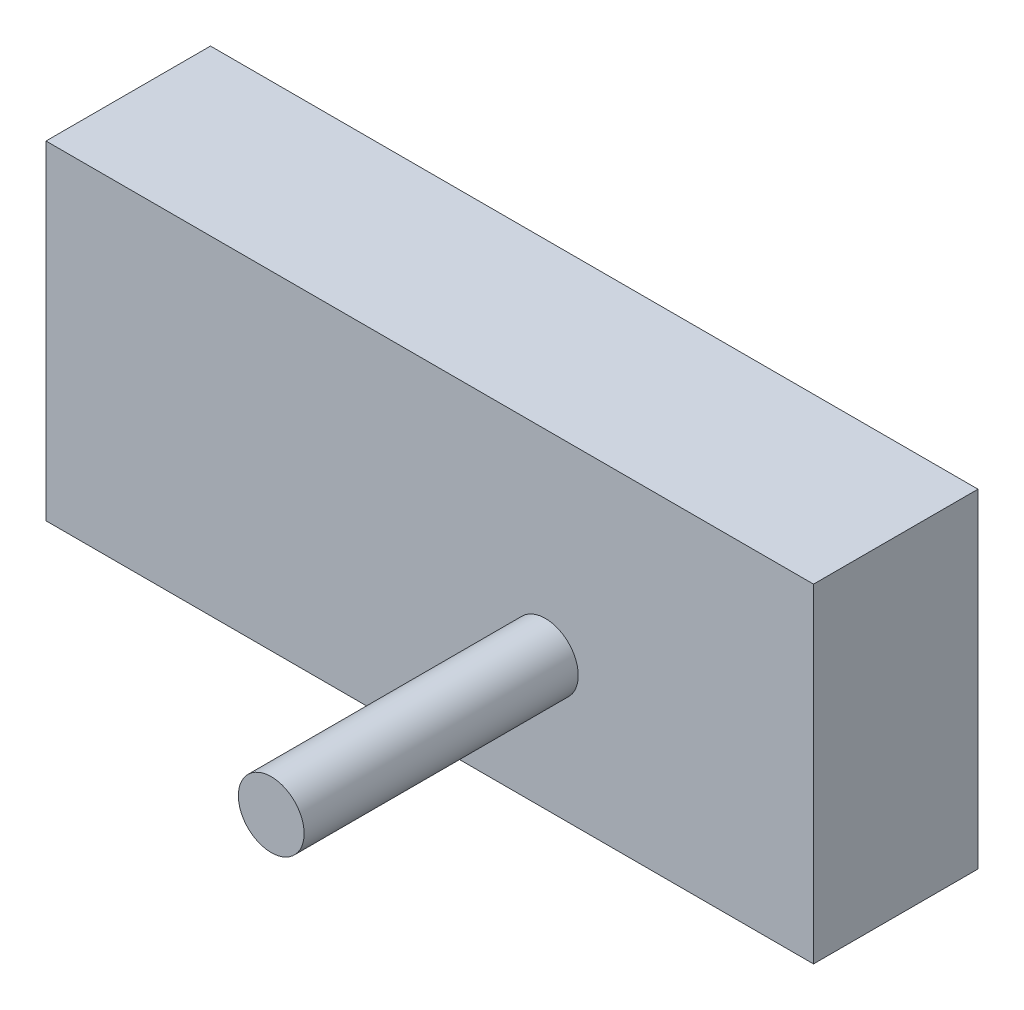
ISO-10303-21;
HEADER;
FILE_DESCRIPTION(('STEP AP214'),'2;1');
FILE_NAME('part.step','',(''),(''),'','','');
FILE_SCHEMA(('AUTOMOTIVE_DESIGN { 1 0 10303 214 1 1 1 1 }'));
ENDSEC;
DATA;
#1=APPLICATION_CONTEXT('core data for automotive mechanical design processes');
#2=APPLICATION_PROTOCOL_DEFINITION('international standard','automotive_design',2000,#1);
#3=PRODUCT_CONTEXT('',#1,'mechanical');
#4=PRODUCT('Part','Part','',(#3));
#5=PRODUCT_RELATED_PRODUCT_CATEGORY('part','',(#4));
#6=PRODUCT_DEFINITION_FORMATION('','',#4);
#7=PRODUCT_DEFINITION_CONTEXT('part definition',#1,'design');
#8=PRODUCT_DEFINITION('design','',#6,#7);
#9=PRODUCT_DEFINITION_SHAPE('','',#8);
#10=(LENGTH_UNIT() NAMED_UNIT(*) SI_UNIT(.MILLI.,.METRE.));
#11=(NAMED_UNIT(*) PLANE_ANGLE_UNIT() SI_UNIT($,.RADIAN.));
#12=(NAMED_UNIT(*) SI_UNIT($,.STERADIAN.) SOLID_ANGLE_UNIT());
#13=UNCERTAINTY_MEASURE_WITH_UNIT(LENGTH_MEASURE(1.E-05),#10,'distance_accuracy_value','');
#14=(GEOMETRIC_REPRESENTATION_CONTEXT(3) GLOBAL_UNCERTAINTY_ASSIGNED_CONTEXT((#13)) GLOBAL_UNIT_ASSIGNED_CONTEXT((#10,
#11,#12)) REPRESENTATION_CONTEXT('',''));
#15=CARTESIAN_POINT('',(0.,0.,0.));
#16=DIRECTION('',(0.,0.,1.));
#17=DIRECTION('',(1.,0.,0.));
#18=AXIS2_PLACEMENT_3D('',#15,#16,#17);
#19=CARTESIAN_POINT('',(-47.7419354838709,29.8387096774194,30.));
#20=DIRECTION('',(1.,0.,0.));
#21=DIRECTION('',(0.,0.,-1.));
#22=AXIS2_PLACEMENT_3D('',#19,#20,#21);
#23=PLANE('',#22);
#24=DIRECTION('',(0.,-1.,0.));
#25=VECTOR('',#24,1.);
#26=CARTESIAN_POINT('',(-47.7419354838709,29.8387096774194,0.));
#27=LINE('',#26,#25);
#28=CARTESIAN_POINT('',(-47.7419354838709,29.8387096774194,0.));
#29=VERTEX_POINT('',#28);
#30=CARTESIAN_POINT('',(-47.7419354838709,-30.1612903225806,0.));
#31=VERTEX_POINT('',#30);
#32=EDGE_CURVE('E96',#29,#31,#27,.T.);
#33=ORIENTED_EDGE('',*,*,#32,.T.);
#34=DIRECTION('',(0.,0.,-1.));
#35=VECTOR('',#34,1.);
#36=CARTESIAN_POINT('',(-47.7419354838709,-30.1612903225806,30.));
#37=LINE('',#36,#35);
#38=CARTESIAN_POINT('',(-47.7419354838709,-30.1612903225806,30.));
#39=VERTEX_POINT('',#38);
#40=EDGE_CURVE('E11',#39,#31,#37,.T.);
#41=ORIENTED_EDGE('',*,*,#40,.F.);
#42=DIRECTION('',(0.,-1.,0.));
#43=VECTOR('',#42,1.);
#44=CARTESIAN_POINT('',(-47.7419354838709,29.8387096774194,30.));
#45=LINE('',#44,#43);
#46=CARTESIAN_POINT('',(-47.7419354838709,29.8387096774194,30.));
#47=VERTEX_POINT('',#46);
#48=EDGE_CURVE('E84',#47,#39,#45,.T.);
#49=ORIENTED_EDGE('',*,*,#48,.F.);
#50=DIRECTION('',(0.,0.,-1.));
#51=VECTOR('',#50,1.);
#52=CARTESIAN_POINT('',(-47.7419354838709,29.8387096774194,30.));
#53=LINE('',#52,#51);
#54=EDGE_CURVE('E92',#47,#29,#53,.T.);
#55=ORIENTED_EDGE('',*,*,#54,.T.);
#56=EDGE_LOOP('',(#33,#41,#49,#55));
#57=FACE_BOUND('',#56,.T.);
#58=ADVANCED_FACE('F33',(#57),#23,.F.);
#59=CARTESIAN_POINT('',(-47.7419354838709,-30.1612903225806,30.));
#60=DIRECTION('',(0.,1.,0.));
#61=DIRECTION('',(-1.,0.,0.));
#62=AXIS2_PLACEMENT_3D('',#59,#60,#61);
#63=PLANE('',#62);
#64=DIRECTION('',(1.,0.,0.));
#65=VECTOR('',#64,1.);
#66=CARTESIAN_POINT('',(-47.7419354838709,-30.1612903225806,0.));
#67=LINE('',#66,#65);
#68=CARTESIAN_POINT('',(92.2580645161291,-30.1612903225806,0.));
#69=VERTEX_POINT('',#68);
#70=EDGE_CURVE('E88',#31,#69,#67,.T.);
#71=ORIENTED_EDGE('',*,*,#70,.T.);
#72=DIRECTION('',(0.,0.,-1.));
#73=VECTOR('',#72,1.);
#74=CARTESIAN_POINT('',(92.2580645161291,-30.1612903225806,30.));
#75=LINE('',#74,#73);
#76=CARTESIAN_POINT('',(92.2580645161291,-30.1612903225806,30.));
#77=VERTEX_POINT('',#76);
#78=EDGE_CURVE('E41',#77,#69,#75,.T.);
#79=ORIENTED_EDGE('',*,*,#78,.F.);
#80=DIRECTION('',(1.,0.,0.));
#81=VECTOR('',#80,1.);
#82=CARTESIAN_POINT('',(-47.7419354838709,-30.1612903225806,30.));
#83=LINE('',#82,#81);
#84=EDGE_CURVE('E79',#39,#77,#83,.T.);
#85=ORIENTED_EDGE('',*,*,#84,.F.);
#86=ORIENTED_EDGE('',*,*,#40,.T.);
#87=EDGE_LOOP('',(#71,#79,#85,#86));
#88=FACE_BOUND('',#87,.T.);
#89=ADVANCED_FACE('F87',(#88),#63,.F.);
#90=CARTESIAN_POINT('',(92.2580645161291,29.8387096774194,30.));
#91=DIRECTION('',(-1.,0.,0.));
#92=DIRECTION('',(0.,0.,1.));
#93=AXIS2_PLACEMENT_3D('',#90,#91,#92);
#94=PLANE('',#93);
#95=DIRECTION('',(0.,1.,0.));
#96=VECTOR('',#95,1.);
#97=CARTESIAN_POINT('',(92.2580645161291,29.8387096774194,0.));
#98=LINE('',#97,#96);
#99=CARTESIAN_POINT('',(92.2580645161291,29.8387096774194,0.));
#100=VERTEX_POINT('',#99);
#101=EDGE_CURVE('E66',#69,#100,#98,.T.);
#102=ORIENTED_EDGE('',*,*,#101,.T.);
#103=DIRECTION('',(0.,0.,-1.));
#104=VECTOR('',#103,1.);
#105=CARTESIAN_POINT('',(92.2580645161291,29.8387096774194,30.));
#106=LINE('',#105,#104);
#107=CARTESIAN_POINT('',(92.2580645161291,29.8387096774194,30.));
#108=VERTEX_POINT('',#107);
#109=EDGE_CURVE('E89',#108,#100,#106,.T.);
#110=ORIENTED_EDGE('',*,*,#109,.F.);
#111=DIRECTION('',(0.,1.,0.));
#112=VECTOR('',#111,1.);
#113=CARTESIAN_POINT('',(92.2580645161291,29.8387096774194,30.));
#114=LINE('',#113,#112);
#115=EDGE_CURVE('E82',#77,#108,#114,.T.);
#116=ORIENTED_EDGE('',*,*,#115,.F.);
#117=ORIENTED_EDGE('',*,*,#78,.T.);
#118=EDGE_LOOP('',(#102,#110,#116,#117));
#119=FACE_BOUND('',#118,.T.);
#120=ADVANCED_FACE('F90',(#119),#94,.F.);
#121=CARTESIAN_POINT('',(-47.7419354838709,29.8387096774194,30.));
#122=DIRECTION('',(0.,-1.,0.));
#123=DIRECTION('',(0.,0.,-1.));
#124=AXIS2_PLACEMENT_3D('',#121,#122,#123);
#125=PLANE('',#124);
#126=DIRECTION('',(-1.,0.,0.));
#127=VECTOR('',#126,1.);
#128=CARTESIAN_POINT('',(-47.7419354838709,29.8387096774194,0.));
#129=LINE('',#128,#127);
#130=EDGE_CURVE('E72',#100,#29,#129,.T.);
#131=ORIENTED_EDGE('',*,*,#130,.T.);
#132=ORIENTED_EDGE('',*,*,#54,.F.);
#133=DIRECTION('',(-1.,0.,0.));
#134=VECTOR('',#133,1.);
#135=CARTESIAN_POINT('',(-47.7419354838709,29.8387096774194,30.));
#136=LINE('',#135,#134);
#137=EDGE_CURVE('E49',#108,#47,#136,.T.);
#138=ORIENTED_EDGE('',*,*,#137,.F.);
#139=ORIENTED_EDGE('',*,*,#109,.T.);
#140=EDGE_LOOP('',(#131,#132,#138,#139));
#141=FACE_BOUND('',#140,.T.);
#142=ADVANCED_FACE('F104',(#141),#125,.F.);
#143=CARTESIAN_POINT('',(0.,0.,30.));
#144=DIRECTION('',(0.,0.,1.));
#145=DIRECTION('',(1.,0.,0.));
#146=AXIS2_PLACEMENT_3D('',#143,#144,#145);
#147=PLANE('',#146);
#148=CARTESIAN_POINT('',(43.3422304037495,-6.03131377992942,30.));
#149=DIRECTION('',(0.,0.,1.));
#150=DIRECTION('',(1.,0.,0.));
#151=AXIS2_PLACEMENT_3D('',#148,#149,#150);
#152=CIRCLE('',#151,6.);
#153=CARTESIAN_POINT('',(49.3422304037495,-6.03131377992942,30.));
#154=VERTEX_POINT('',#153);
#155=EDGE_CURVE('E110',#154,#154,#152,.T.);
#156=ORIENTED_EDGE('',*,*,#155,.F.);
#157=EDGE_LOOP('',(#156));
#158=FACE_BOUND('',#157,.T.);
#159=ORIENTED_EDGE('',*,*,#48,.T.);
#160=ORIENTED_EDGE('',*,*,#84,.T.);
#161=ORIENTED_EDGE('',*,*,#115,.T.);
#162=ORIENTED_EDGE('',*,*,#137,.T.);
#163=EDGE_LOOP('',(#159,#160,#161,#162));
#164=FACE_BOUND('',#163,.T.);
#165=ADVANCED_FACE('F80',(#158,#164),#147,.T.);
#166=CARTESIAN_POINT('',(0.,0.,0.));
#167=DIRECTION('',(0.,0.,1.));
#168=DIRECTION('',(1.,0.,0.));
#169=AXIS2_PLACEMENT_3D('',#166,#167,#168);
#170=PLANE('',#169);
#171=ORIENTED_EDGE('',*,*,#32,.F.);
#172=ORIENTED_EDGE('',*,*,#130,.F.);
#173=ORIENTED_EDGE('',*,*,#101,.F.);
#174=ORIENTED_EDGE('',*,*,#70,.F.);
#175=EDGE_LOOP('',(#171,#172,#173,#174));
#176=FACE_BOUND('',#175,.T.);
#177=ADVANCED_FACE('F107',(#176),#170,.F.);
#178=CARTESIAN_POINT('',(43.3422304037495,-6.03131377992942,80.));
#179=DIRECTION('',(0.,0.,-1.));
#180=DIRECTION('',(-1.,0.,0.));
#181=AXIS2_PLACEMENT_3D('',#178,#179,#180);
#182=CYLINDRICAL_SURFACE('',#181,6.);
#183=CARTESIAN_POINT('',(43.3422304037495,-6.03131377992942,80.));
#184=DIRECTION('',(0.,0.,1.));
#185=DIRECTION('',(1.,0.,0.));
#186=AXIS2_PLACEMENT_3D('',#183,#184,#185);
#187=CIRCLE('',#186,6.);
#188=CARTESIAN_POINT('',(49.3422304037495,-6.03131377992942,80.));
#189=VERTEX_POINT('',#188);
#190=EDGE_CURVE('E99',#189,#189,#187,.T.);
#191=ORIENTED_EDGE('',*,*,#190,.F.);
#192=EDGE_LOOP('',(#191));
#193=FACE_BOUND('',#192,.T.);
#194=ORIENTED_EDGE('',*,*,#155,.T.);
#195=EDGE_LOOP('',(#194));
#196=FACE_BOUND('',#195,.T.);
#197=ADVANCED_FACE('F118',(#193,#196),#182,.T.);
#198=CARTESIAN_POINT('',(43.3422304037495,-6.03131377992942,80.));
#199=DIRECTION('',(0.,0.,1.));
#200=DIRECTION('',(1.,0.,0.));
#201=AXIS2_PLACEMENT_3D('',#198,#199,#200);
#202=PLANE('',#201);
#203=ORIENTED_EDGE('',*,*,#190,.T.);
#204=EDGE_LOOP('',(#203));
#205=FACE_BOUND('',#204,.T.);
#206=ADVANCED_FACE('F116',(#205),#202,.T.);
#207=CLOSED_SHELL('',(#58,#89,#120,#142,#165,#177,#197,#206));
#208=MANIFOLD_SOLID_BREP('B2',#207);
#209=ADVANCED_BREP_SHAPE_REPRESENTATION('',(#18,#208),#14);
#210=SHAPE_DEFINITION_REPRESENTATION(#9,#209);
ENDSEC;
END-ISO-10303-21;
